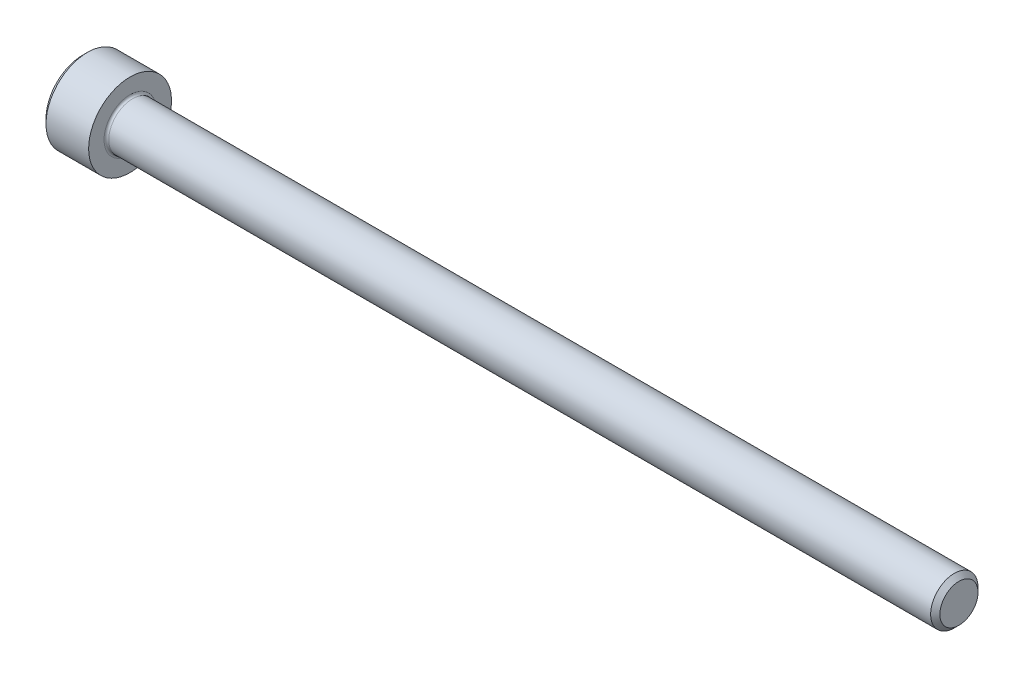
ISO-10303-21;
HEADER;
FILE_DESCRIPTION(('STEP AP214'),'2;1');
FILE_NAME('part.step','',(''),(''),'','','');
FILE_SCHEMA(('AUTOMOTIVE_DESIGN { 1 0 10303 214 1 1 1 1 }'));
ENDSEC;
DATA;
#1=APPLICATION_CONTEXT('core data for automotive mechanical design processes');
#2=APPLICATION_PROTOCOL_DEFINITION('international standard','automotive_design',2000,#1);
#3=PRODUCT_CONTEXT('',#1,'mechanical');
#4=PRODUCT('Part','Part','',(#3));
#5=PRODUCT_RELATED_PRODUCT_CATEGORY('part','',(#4));
#6=PRODUCT_DEFINITION_FORMATION('','',#4);
#7=PRODUCT_DEFINITION_CONTEXT('part definition',#1,'design');
#8=PRODUCT_DEFINITION('design','',#6,#7);
#9=PRODUCT_DEFINITION_SHAPE('','',#8);
#10=(LENGTH_UNIT() NAMED_UNIT(*) SI_UNIT(.MILLI.,.METRE.));
#11=(NAMED_UNIT(*) PLANE_ANGLE_UNIT() SI_UNIT($,.RADIAN.));
#12=(NAMED_UNIT(*) SI_UNIT($,.STERADIAN.) SOLID_ANGLE_UNIT());
#13=UNCERTAINTY_MEASURE_WITH_UNIT(LENGTH_MEASURE(1.E-05),#10,'distance_accuracy_value','');
#14=(GEOMETRIC_REPRESENTATION_CONTEXT(3) GLOBAL_UNCERTAINTY_ASSIGNED_CONTEXT((#13)) GLOBAL_UNIT_ASSIGNED_CONTEXT((#10,
#11,#12)) REPRESENTATION_CONTEXT('',''));
#15=CARTESIAN_POINT('',(0.,0.,0.));
#16=DIRECTION('',(0.,0.,1.));
#17=DIRECTION('',(1.,0.,0.));
#18=AXIS2_PLACEMENT_3D('',#15,#16,#17);
#19=CARTESIAN_POINT('',(0.,0.,0.));
#20=DIRECTION('',(-1.,0.,0.));
#21=DIRECTION('',(0.,0.,1.));
#22=AXIS2_PLACEMENT_3D('',#19,#20,#21);
#23=PLANE('',#22);
#24=DIRECTION('',(0.,-0.5,0.866025403784439));
#25=VECTOR('',#24,1.);
#26=CARTESIAN_POINT('',(0.,1.77304267668134,0.));
#27=LINE('',#26,#25);
#28=CARTESIAN_POINT('',(0.,1.77304267668134,0.));
#29=VERTEX_POINT('',#28);
#30=CARTESIAN_POINT('',(0.,0.886521338340669,1.5355));
#31=VERTEX_POINT('',#30);
#32=EDGE_CURVE('E247',#29,#31,#27,.T.);
#33=ORIENTED_EDGE('',*,*,#32,.T.);
#34=DIRECTION('',(0.,1.,0.));
#35=VECTOR('',#34,1.);
#36=CARTESIAN_POINT('',(0.,-0.886521338340672,1.5355));
#37=LINE('',#36,#35);
#38=CARTESIAN_POINT('',(0.,-0.886521338340672,1.5355));
#39=VERTEX_POINT('',#38);
#40=EDGE_CURVE('E113',#39,#31,#37,.T.);
#41=ORIENTED_EDGE('',*,*,#40,.F.);
#42=DIRECTION('',(0.,-0.5,-0.866025403784438));
#43=VECTOR('',#42,1.);
#44=CARTESIAN_POINT('',(0.,-0.886521338340672,1.5355));
#45=LINE('',#44,#43);
#46=CARTESIAN_POINT('',(0.,-1.77304267668134,0.));
#47=VERTEX_POINT('',#46);
#48=EDGE_CURVE('E250',#39,#47,#45,.T.);
#49=ORIENTED_EDGE('',*,*,#48,.T.);
#50=DIRECTION('',(0.,0.5,-0.866025403784439));
#51=VECTOR('',#50,1.);
#52=CARTESIAN_POINT('',(0.,-1.77304267668134,0.));
#53=LINE('',#52,#51);
#54=CARTESIAN_POINT('',(0.,-0.886521338340676,-1.5355));
#55=VERTEX_POINT('',#54);
#56=EDGE_CURVE('E253',#47,#55,#53,.T.);
#57=ORIENTED_EDGE('',*,*,#56,.T.);
#58=DIRECTION('',(0.,-1.,0.));
#59=VECTOR('',#58,1.);
#60=CARTESIAN_POINT('',(0.,0.886521338340665,-1.5355));
#61=LINE('',#60,#59);
#62=CARTESIAN_POINT('',(0.,0.886521338340665,-1.5355));
#63=VERTEX_POINT('',#62);
#64=EDGE_CURVE('E256',#63,#55,#61,.T.);
#65=ORIENTED_EDGE('',*,*,#64,.F.);
#66=DIRECTION('',(0.,-0.5,-0.866025403784438));
#67=VECTOR('',#66,1.);
#68=CARTESIAN_POINT('',(0.,1.77304267668134,0.));
#69=LINE('',#68,#67);
#70=EDGE_CURVE('E108',#29,#63,#69,.T.);
#71=ORIENTED_EDGE('',*,*,#70,.F.);
#72=EDGE_LOOP('',(#33,#41,#49,#57,#65,#71));
#73=FACE_BOUND('',#72,.T.);
#74=CARTESIAN_POINT('',(0.,0.,0.));
#75=DIRECTION('',(-1.,0.,0.));
#76=DIRECTION('',(0.,0.,1.));
#77=AXIS2_PLACEMENT_3D('',#74,#75,#76);
#78=CIRCLE('',#77,3.1);
#79=CARTESIAN_POINT('',(0.,0.,3.1));
#80=VERTEX_POINT('',#79);
#81=EDGE_CURVE('E137',#80,#80,#78,.T.);
#82=ORIENTED_EDGE('',*,*,#81,.T.);
#83=EDGE_LOOP('',(#82));
#84=FACE_BOUND('',#83,.T.);
#85=ADVANCED_FACE('F17',(#73,#84),#23,.T.);
#86=CARTESIAN_POINT('',(0.,0.,0.));
#87=DIRECTION('',(1.,0.,0.));
#88=DIRECTION('',(0.,0.,-1.));
#89=AXIS2_PLACEMENT_3D('',#86,#87,#88);
#90=CONICAL_SURFACE('',#89,3.1,0.785398163397448);
#91=CARTESIAN_POINT('',(0.4,0.,0.));
#92=DIRECTION('',(-1.,0.,0.));
#93=DIRECTION('',(0.,0.,1.));
#94=AXIS2_PLACEMENT_3D('',#91,#92,#93);
#95=CIRCLE('',#94,3.5);
#96=CARTESIAN_POINT('',(0.4,0.,3.5));
#97=VERTEX_POINT('',#96);
#98=EDGE_CURVE('E134',#97,#97,#95,.T.);
#99=ORIENTED_EDGE('',*,*,#98,.T.);
#100=EDGE_LOOP('',(#99));
#101=FACE_BOUND('',#100,.T.);
#102=ORIENTED_EDGE('',*,*,#81,.F.);
#103=EDGE_LOOP('',(#102));
#104=FACE_BOUND('',#103,.T.);
#105=ADVANCED_FACE('F160',(#101,#104),#90,.T.);
#106=CARTESIAN_POINT('',(-31.75,0.,0.));
#107=DIRECTION('',(-1.,0.,0.));
#108=DIRECTION('',(0.,0.,1.));
#109=AXIS2_PLACEMENT_3D('',#106,#107,#108);
#110=CYLINDRICAL_SURFACE('',#109,3.5);
#111=CARTESIAN_POINT('',(4.,0.,0.));
#112=DIRECTION('',(-1.,0.,0.));
#113=DIRECTION('',(0.,0.,1.));
#114=AXIS2_PLACEMENT_3D('',#111,#112,#113);
#115=CIRCLE('',#114,3.5);
#116=CARTESIAN_POINT('',(4.,0.,3.5));
#117=VERTEX_POINT('',#116);
#118=EDGE_CURVE('E131',#117,#117,#115,.T.);
#119=ORIENTED_EDGE('',*,*,#118,.T.);
#120=EDGE_LOOP('',(#119));
#121=FACE_BOUND('',#120,.T.);
#122=ORIENTED_EDGE('',*,*,#98,.F.);
#123=EDGE_LOOP('',(#122));
#124=FACE_BOUND('',#123,.T.);
#125=ADVANCED_FACE('F166',(#121,#124),#110,.T.);
#126=CARTESIAN_POINT('',(4.,3.5,0.));
#127=DIRECTION('',(1.,0.,0.));
#128=DIRECTION('',(0.,0.,-1.));
#129=AXIS2_PLACEMENT_3D('',#126,#127,#128);
#130=PLANE('',#129);
#131=CARTESIAN_POINT('',(4.,0.,0.));
#132=DIRECTION('',(1.,0.,0.));
#133=DIRECTION('',(0.,0.,-1.));
#134=AXIS2_PLACEMENT_3D('',#131,#132,#133);
#135=CIRCLE('',#134,2.2);
#136=CARTESIAN_POINT('',(4.,0.,-2.2));
#137=VERTEX_POINT('',#136);
#138=EDGE_CURVE('E25',#137,#137,#135,.F.);
#139=ORIENTED_EDGE('',*,*,#138,.T.);
#140=EDGE_LOOP('',(#139));
#141=FACE_BOUND('',#140,.T.);
#142=ORIENTED_EDGE('',*,*,#118,.F.);
#143=EDGE_LOOP('',(#142));
#144=FACE_BOUND('',#143,.T.);
#145=ADVANCED_FACE('F142',(#141,#144),#130,.T.);
#146=CARTESIAN_POINT('',(-31.75,0.,0.));
#147=DIRECTION('',(-1.,0.,0.));
#148=DIRECTION('',(0.,0.,1.));
#149=AXIS2_PLACEMENT_3D('',#146,#147,#148);
#150=CYLINDRICAL_SURFACE('',#149,2.);
#151=CARTESIAN_POINT('',(4.2,0.,0.));
#152=DIRECTION('',(1.,0.,0.));
#153=DIRECTION('',(0.,0.,-1.));
#154=AXIS2_PLACEMENT_3D('',#151,#152,#153);
#155=CIRCLE('',#154,2.);
#156=CARTESIAN_POINT('',(4.2,0.,-2.));
#157=VERTEX_POINT('',#156);
#158=EDGE_CURVE('E11',#157,#157,#155,.T.);
#159=ORIENTED_EDGE('',*,*,#158,.T.);
#160=EDGE_LOOP('',(#159));
#161=FACE_BOUND('',#160,.T.);
#162=CARTESIAN_POINT('',(73.61,0.,0.));
#163=DIRECTION('',(-1.,0.,0.));
#164=DIRECTION('',(0.,0.,1.));
#165=AXIS2_PLACEMENT_3D('',#162,#163,#164);
#166=CIRCLE('',#165,1.99999999999997);
#167=CARTESIAN_POINT('',(73.61,0.,1.99999999999997));
#168=VERTEX_POINT('',#167);
#169=EDGE_CURVE('E128',#168,#168,#166,.T.);
#170=ORIENTED_EDGE('',*,*,#169,.T.);
#171=EDGE_LOOP('',(#170));
#172=FACE_BOUND('',#171,.T.);
#173=ADVANCED_FACE('F176',(#161,#172),#150,.T.);
#174=CARTESIAN_POINT('',(74.,0.,0.));
#175=DIRECTION('',(-1.,0.,0.));
#176=DIRECTION('',(0.,0.,1.));
#177=AXIS2_PLACEMENT_3D('',#174,#175,#176);
#178=CONICAL_SURFACE('',#177,1.61,0.78539816339739);
#179=ORIENTED_EDGE('',*,*,#169,.F.);
#180=EDGE_LOOP('',(#179));
#181=FACE_BOUND('',#180,.T.);
#182=CARTESIAN_POINT('',(74.,0.,0.));
#183=DIRECTION('',(-1.,0.,0.));
#184=DIRECTION('',(0.,0.,1.));
#185=AXIS2_PLACEMENT_3D('',#182,#183,#184);
#186=CIRCLE('',#185,1.61);
#187=CARTESIAN_POINT('',(74.,0.,1.61));
#188=VERTEX_POINT('',#187);
#189=EDGE_CURVE('E124',#188,#188,#186,.T.);
#190=ORIENTED_EDGE('',*,*,#189,.T.);
#191=EDGE_LOOP('',(#190));
#192=FACE_BOUND('',#191,.T.);
#193=ADVANCED_FACE('F155',(#181,#192),#178,.T.);
#194=CARTESIAN_POINT('',(74.,1.61,0.));
#195=DIRECTION('',(1.,0.,0.));
#196=DIRECTION('',(0.,0.,-1.));
#197=AXIS2_PLACEMENT_3D('',#194,#195,#196);
#198=PLANE('',#197);
#199=ORIENTED_EDGE('',*,*,#189,.F.);
#200=EDGE_LOOP('',(#199));
#201=FACE_BOUND('',#200,.T.);
#202=ADVANCED_FACE('F146',(#201),#198,.T.);
#203=CARTESIAN_POINT('',(4.2,0.,0.));
#204=DIRECTION('',(1.,0.,0.));
#205=DIRECTION('',(0.,0.,-1.));
#206=AXIS2_PLACEMENT_3D('',#203,#204,#205);
#207=TOROIDAL_SURFACE('',#206,2.2,0.2);
#208=ORIENTED_EDGE('',*,*,#158,.F.);
#209=EDGE_LOOP('',(#208));
#210=FACE_BOUND('',#209,.T.);
#211=ORIENTED_EDGE('',*,*,#138,.F.);
#212=EDGE_LOOP('',(#211));
#213=FACE_BOUND('',#212,.T.);
#214=ADVANCED_FACE('F19',(#210,#213),#207,.F.);
#215=CARTESIAN_POINT('',(2.,1.77304267668134,0.));
#216=DIRECTION('',(0.,-0.866025403784439,-0.5));
#217=DIRECTION('',(0.,0.5,-0.866025403784439));
#218=AXIS2_PLACEMENT_3D('',#215,#216,#217);
#219=PLANE('',#218);
#220=ORIENTED_EDGE('',*,*,#32,.F.);
#221=DIRECTION('',(-1.,0.,0.));
#222=VECTOR('',#221,1.);
#223=CARTESIAN_POINT('',(2.,1.77304267668134,0.));
#224=LINE('',#223,#222);
#225=CARTESIAN_POINT('',(2.,1.77304267668134,0.));
#226=VERTEX_POINT('',#225);
#227=EDGE_CURVE('E237',#226,#29,#224,.T.);
#228=ORIENTED_EDGE('',*,*,#227,.F.);
#229=DIRECTION('',(0.,-0.5,0.866025403784439));
#230=VECTOR('',#229,1.);
#231=CARTESIAN_POINT('',(2.,1.77304267668134,0.));
#232=LINE('',#231,#230);
#233=CARTESIAN_POINT('',(2.,1.329782007511,0.76775));
#234=VERTEX_POINT('',#233);
#235=EDGE_CURVE('E100',#226,#234,#232,.T.);
#236=ORIENTED_EDGE('',*,*,#235,.T.);
#237=CARTESIAN_POINT('',(2.,0.886521338340669,1.5355));
#238=VERTEX_POINT('',#237);
#239=EDGE_CURVE('E91',#234,#238,#232,.T.);
#240=ORIENTED_EDGE('',*,*,#239,.T.);
#241=DIRECTION('',(-1.,0.,0.));
#242=VECTOR('',#241,1.);
#243=CARTESIAN_POINT('',(2.,0.886521338340669,1.5355));
#244=LINE('',#243,#242);
#245=EDGE_CURVE('E105',#238,#31,#244,.T.);
#246=ORIENTED_EDGE('',*,*,#245,.T.);
#247=EDGE_LOOP('',(#220,#228,#236,#240,#246));
#248=FACE_BOUND('',#247,.T.);
#249=ADVANCED_FACE('F104',(#248),#219,.T.);
#250=CARTESIAN_POINT('',(2.,-0.886521338340672,1.5355));
#251=DIRECTION('',(0.,0.,1.));
#252=DIRECTION('',(0.,-1.,0.));
#253=AXIS2_PLACEMENT_3D('',#250,#251,#252);
#254=PLANE('',#253);
#255=ORIENTED_EDGE('',*,*,#40,.T.);
#256=ORIENTED_EDGE('',*,*,#245,.F.);
#257=DIRECTION('',(0.,1.,0.));
#258=VECTOR('',#257,1.);
#259=CARTESIAN_POINT('',(2.,-0.886521338340672,1.5355));
#260=LINE('',#259,#258);
#261=CARTESIAN_POINT('',(2.,0.,1.5355));
#262=VERTEX_POINT('',#261);
#263=EDGE_CURVE('E88',#262,#238,#260,.T.);
#264=ORIENTED_EDGE('',*,*,#263,.F.);
#265=CARTESIAN_POINT('',(2.,-0.886521338340672,1.5355));
#266=VERTEX_POINT('',#265);
#267=EDGE_CURVE('E99',#266,#262,#260,.T.);
#268=ORIENTED_EDGE('',*,*,#267,.F.);
#269=DIRECTION('',(-1.,0.,0.));
#270=VECTOR('',#269,1.);
#271=CARTESIAN_POINT('',(2.,-0.886521338340672,1.5355));
#272=LINE('',#271,#270);
#273=EDGE_CURVE('E115',#266,#39,#272,.T.);
#274=ORIENTED_EDGE('',*,*,#273,.T.);
#275=EDGE_LOOP('',(#255,#256,#264,#268,#274));
#276=FACE_BOUND('',#275,.T.);
#277=ADVANCED_FACE('F110',(#276),#254,.F.);
#278=CARTESIAN_POINT('',(2.,-0.886521338340672,1.5355));
#279=DIRECTION('',(0.,0.866025403784438,-0.5));
#280=DIRECTION('',(0.,0.5,0.866025403784438));
#281=AXIS2_PLACEMENT_3D('',#278,#279,#280);
#282=PLANE('',#281);
#283=ORIENTED_EDGE('',*,*,#48,.F.);
#284=ORIENTED_EDGE('',*,*,#273,.F.);
#285=DIRECTION('',(0.,-0.5,-0.866025403784438));
#286=VECTOR('',#285,1.);
#287=CARTESIAN_POINT('',(2.,-0.886521338340672,1.5355));
#288=LINE('',#287,#286);
#289=CARTESIAN_POINT('',(2.,-1.32978200751101,0.76775));
#290=VERTEX_POINT('',#289);
#291=EDGE_CURVE('E276',#266,#290,#288,.T.);
#292=ORIENTED_EDGE('',*,*,#291,.T.);
#293=CARTESIAN_POINT('',(2.,-1.77304267668134,0.));
#294=VERTEX_POINT('',#293);
#295=EDGE_CURVE('E265',#290,#294,#288,.T.);
#296=ORIENTED_EDGE('',*,*,#295,.T.);
#297=DIRECTION('',(-1.,0.,0.));
#298=VECTOR('',#297,1.);
#299=CARTESIAN_POINT('',(2.,-1.77304267668134,0.));
#300=LINE('',#299,#298);
#301=EDGE_CURVE('E120',#294,#47,#300,.T.);
#302=ORIENTED_EDGE('',*,*,#301,.T.);
#303=EDGE_LOOP('',(#283,#284,#292,#296,#302));
#304=FACE_BOUND('',#303,.T.);
#305=ADVANCED_FACE('F189',(#304),#282,.T.);
#306=CARTESIAN_POINT('',(2.,-1.77304267668134,0.));
#307=DIRECTION('',(0.,0.866025403784439,0.5));
#308=DIRECTION('',(0.,-0.5,0.866025403784439));
#309=AXIS2_PLACEMENT_3D('',#306,#307,#308);
#310=PLANE('',#309);
#311=ORIENTED_EDGE('',*,*,#56,.F.);
#312=ORIENTED_EDGE('',*,*,#301,.F.);
#313=DIRECTION('',(0.,0.5,-0.866025403784439));
#314=VECTOR('',#313,1.);
#315=CARTESIAN_POINT('',(2.,-1.77304267668134,0.));
#316=LINE('',#315,#314);
#317=CARTESIAN_POINT('',(2.,-1.32978200751101,-0.76775));
#318=VERTEX_POINT('',#317);
#319=EDGE_CURVE('E243',#294,#318,#316,.T.);
#320=ORIENTED_EDGE('',*,*,#319,.T.);
#321=CARTESIAN_POINT('',(2.,-0.886521338340676,-1.5355));
#322=VERTEX_POINT('',#321);
#323=EDGE_CURVE('E275',#318,#322,#316,.T.);
#324=ORIENTED_EDGE('',*,*,#323,.T.);
#325=DIRECTION('',(-1.,0.,0.));
#326=VECTOR('',#325,1.);
#327=CARTESIAN_POINT('',(2.,-0.886521338340676,-1.5355));
#328=LINE('',#327,#326);
#329=EDGE_CURVE('E236',#322,#55,#328,.T.);
#330=ORIENTED_EDGE('',*,*,#329,.T.);
#331=EDGE_LOOP('',(#311,#312,#320,#324,#330));
#332=FACE_BOUND('',#331,.T.);
#333=ADVANCED_FACE('F192',(#332),#310,.T.);
#334=CARTESIAN_POINT('',(2.,0.886521338340665,-1.5355));
#335=DIRECTION('',(0.,0.,-1.));
#336=DIRECTION('',(0.,1.,0.));
#337=AXIS2_PLACEMENT_3D('',#334,#335,#336);
#338=PLANE('',#337);
#339=ORIENTED_EDGE('',*,*,#64,.T.);
#340=ORIENTED_EDGE('',*,*,#329,.F.);
#341=DIRECTION('',(0.,-1.,0.));
#342=VECTOR('',#341,1.);
#343=CARTESIAN_POINT('',(2.,0.886521338340665,-1.5355));
#344=LINE('',#343,#342);
#345=CARTESIAN_POINT('',(2.,0.,-1.5355));
#346=VERTEX_POINT('',#345);
#347=EDGE_CURVE('E240',#346,#322,#344,.T.);
#348=ORIENTED_EDGE('',*,*,#347,.F.);
#349=CARTESIAN_POINT('',(2.,0.886521338340665,-1.5355));
#350=VERTEX_POINT('',#349);
#351=EDGE_CURVE('E32',#350,#346,#344,.T.);
#352=ORIENTED_EDGE('',*,*,#351,.F.);
#353=DIRECTION('',(-1.,0.,0.));
#354=VECTOR('',#353,1.);
#355=CARTESIAN_POINT('',(2.,0.886521338340665,-1.5355));
#356=LINE('',#355,#354);
#357=EDGE_CURVE('E233',#350,#63,#356,.T.);
#358=ORIENTED_EDGE('',*,*,#357,.T.);
#359=EDGE_LOOP('',(#339,#340,#348,#352,#358));
#360=FACE_BOUND('',#359,.T.);
#361=ADVANCED_FACE('F196',(#360),#338,.F.);
#362=CARTESIAN_POINT('',(2.,1.77304267668134,0.));
#363=DIRECTION('',(0.,0.866025403784438,-0.5));
#364=DIRECTION('',(0.,0.5,0.866025403784438));
#365=AXIS2_PLACEMENT_3D('',#362,#363,#364);
#366=PLANE('',#365);
#367=ORIENTED_EDGE('',*,*,#70,.T.);
#368=ORIENTED_EDGE('',*,*,#357,.F.);
#369=DIRECTION('',(0.,-0.5,-0.866025403784438));
#370=VECTOR('',#369,1.);
#371=CARTESIAN_POINT('',(2.,1.77304267668134,0.));
#372=LINE('',#371,#370);
#373=CARTESIAN_POINT('',(2.,1.329782007511,-0.76775));
#374=VERTEX_POINT('',#373);
#375=EDGE_CURVE('E223',#374,#350,#372,.T.);
#376=ORIENTED_EDGE('',*,*,#375,.F.);
#377=EDGE_CURVE('E229',#226,#374,#372,.T.);
#378=ORIENTED_EDGE('',*,*,#377,.F.);
#379=ORIENTED_EDGE('',*,*,#227,.T.);
#380=EDGE_LOOP('',(#367,#368,#376,#378,#379));
#381=FACE_BOUND('',#380,.T.);
#382=ADVANCED_FACE('F200',(#381),#366,.F.);
#383=CARTESIAN_POINT('',(2.,1.77304267668134,0.));
#384=DIRECTION('',(1.,0.,0.));
#385=DIRECTION('',(0.,0.,-1.));
#386=AXIS2_PLACEMENT_3D('',#383,#384,#385);
#387=PLANE('',#386);
#388=ORIENTED_EDGE('',*,*,#347,.T.);
#389=ORIENTED_EDGE('',*,*,#323,.F.);
#390=CARTESIAN_POINT('',(2.,0.,0.));
#391=DIRECTION('',(-1.,0.,0.));
#392=DIRECTION('',(0.,0.,1.));
#393=AXIS2_PLACEMENT_3D('',#390,#391,#392);
#394=CIRCLE('',#393,1.5355);
#395=EDGE_CURVE('E271',#346,#318,#394,.T.);
#396=ORIENTED_EDGE('',*,*,#395,.F.);
#397=EDGE_LOOP('',(#388,#389,#396));
#398=FACE_BOUND('',#397,.T.);
#399=ADVANCED_FACE('F204',(#398),#387,.F.);
#400=ORIENTED_EDGE('',*,*,#319,.F.);
#401=ORIENTED_EDGE('',*,*,#295,.F.);
#402=EDGE_CURVE('E118',#318,#290,#394,.T.);
#403=ORIENTED_EDGE('',*,*,#402,.F.);
#404=EDGE_LOOP('',(#400,#401,#403));
#405=FACE_BOUND('',#404,.T.);
#406=ADVANCED_FACE('F207',(#405),#387,.F.);
#407=ORIENTED_EDGE('',*,*,#291,.F.);
#408=ORIENTED_EDGE('',*,*,#267,.T.);
#409=EDGE_CURVE('E114',#290,#262,#394,.T.);
#410=ORIENTED_EDGE('',*,*,#409,.F.);
#411=EDGE_LOOP('',(#407,#408,#410));
#412=FACE_BOUND('',#411,.T.);
#413=ADVANCED_FACE('F213',(#412),#387,.F.);
#414=ORIENTED_EDGE('',*,*,#263,.T.);
#415=ORIENTED_EDGE('',*,*,#239,.F.);
#416=EDGE_CURVE('E94',#262,#234,#394,.T.);
#417=ORIENTED_EDGE('',*,*,#416,.F.);
#418=EDGE_LOOP('',(#414,#415,#417));
#419=FACE_BOUND('',#418,.T.);
#420=ADVANCED_FACE('F90',(#419),#387,.F.);
#421=ORIENTED_EDGE('',*,*,#235,.F.);
#422=ORIENTED_EDGE('',*,*,#377,.T.);
#423=EDGE_CURVE('E125',#234,#374,#394,.T.);
#424=ORIENTED_EDGE('',*,*,#423,.F.);
#425=EDGE_LOOP('',(#421,#422,#424));
#426=FACE_BOUND('',#425,.T.);
#427=ADVANCED_FACE('F216',(#426),#387,.F.);
#428=ORIENTED_EDGE('',*,*,#375,.T.);
#429=ORIENTED_EDGE('',*,*,#351,.T.);
#430=EDGE_CURVE('E226',#374,#346,#394,.T.);
#431=ORIENTED_EDGE('',*,*,#430,.F.);
#432=EDGE_LOOP('',(#428,#429,#431));
#433=FACE_BOUND('',#432,.T.);
#434=ADVANCED_FACE('F185',(#433),#387,.F.);
#435=CARTESIAN_POINT('',(2.,0.,0.));
#436=DIRECTION('',(-1.,0.,0.));
#437=DIRECTION('',(0.,0.,1.));
#438=AXIS2_PLACEMENT_3D('',#435,#436,#437);
#439=CONICAL_SURFACE('',#438,1.5355,1.0471975511966);
#440=CARTESIAN_POINT('',(2.88652133834068,0.,0.));
#441=VERTEX_POINT('',#440);
#442=VERTEX_LOOP('',#441);
#443=FACE_BOUND('',#442,.T.);
#444=ORIENTED_EDGE('',*,*,#416,.T.);
#445=ORIENTED_EDGE('',*,*,#423,.T.);
#446=ORIENTED_EDGE('',*,*,#430,.T.);
#447=ORIENTED_EDGE('',*,*,#395,.T.);
#448=ORIENTED_EDGE('',*,*,#402,.T.);
#449=ORIENTED_EDGE('',*,*,#409,.T.);
#450=EDGE_LOOP('',(#444,#445,#446,#447,#448,#449));
#451=FACE_BOUND('',#450,.T.);
#452=ADVANCED_FACE('F183',(#443,#451),#439,.F.);
#453=CLOSED_SHELL('',(#85,#105,#125,#145,#173,#193,#202,#214,#249,#277,#305,#333,#361,#382,#399,
#406,#413,#420,#427,#434,#452));
#454=MANIFOLD_SOLID_BREP('B1',#453);
#455=ADVANCED_BREP_SHAPE_REPRESENTATION('',(#18,#454),#14);
#456=SHAPE_DEFINITION_REPRESENTATION(#9,#455);
ENDSEC;
END-ISO-10303-21;
